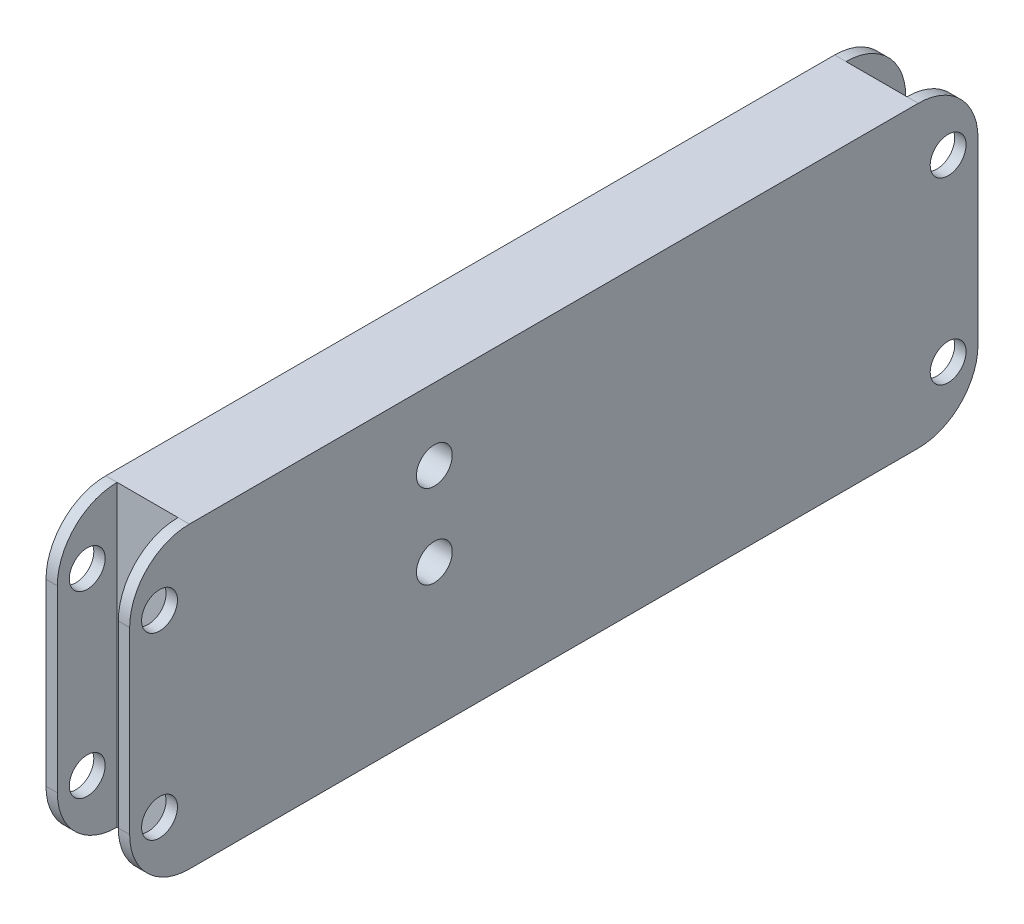
ISO-10303-21;
HEADER;
FILE_DESCRIPTION(('STEP AP214'),'2;1');
FILE_NAME('part.step','',(''),(''),'','','');
FILE_SCHEMA(('AUTOMOTIVE_DESIGN { 1 0 10303 214 1 1 1 1 }'));
ENDSEC;
DATA;
#1=APPLICATION_CONTEXT('core data for automotive mechanical design processes');
#2=APPLICATION_PROTOCOL_DEFINITION('international standard','automotive_design',2000,#1);
#3=PRODUCT_CONTEXT('',#1,'mechanical');
#4=PRODUCT('Part','Part','',(#3));
#5=PRODUCT_RELATED_PRODUCT_CATEGORY('part','',(#4));
#6=PRODUCT_DEFINITION_FORMATION('','',#4);
#7=PRODUCT_DEFINITION_CONTEXT('part definition',#1,'design');
#8=PRODUCT_DEFINITION('design','',#6,#7);
#9=PRODUCT_DEFINITION_SHAPE('','',#8);
#10=(LENGTH_UNIT() NAMED_UNIT(*) SI_UNIT(.MILLI.,.METRE.));
#11=(NAMED_UNIT(*) PLANE_ANGLE_UNIT() SI_UNIT($,.RADIAN.));
#12=(NAMED_UNIT(*) SI_UNIT($,.STERADIAN.) SOLID_ANGLE_UNIT());
#13=UNCERTAINTY_MEASURE_WITH_UNIT(LENGTH_MEASURE(1.E-05),#10,'distance_accuracy_value','');
#14=(GEOMETRIC_REPRESENTATION_CONTEXT(3) GLOBAL_UNCERTAINTY_ASSIGNED_CONTEXT((#13)) GLOBAL_UNIT_ASSIGNED_CONTEXT((#10,
#11,#12)) REPRESENTATION_CONTEXT('',''));
#15=CARTESIAN_POINT('',(0.,0.,0.));
#16=DIRECTION('',(0.,0.,1.));
#17=DIRECTION('',(1.,0.,0.));
#18=AXIS2_PLACEMENT_3D('',#15,#16,#17);
#19=CARTESIAN_POINT('',(-83.4298114071874,-147.075228064279,9.99999999999999));
#20=DIRECTION('',(1.,0.,0.));
#21=DIRECTION('',(0.,1.,0.));
#22=AXIS2_PLACEMENT_3D('',#19,#20,#21);
#23=CYLINDRICAL_SURFACE('',#22,1.5);
#24=CARTESIAN_POINT('',(-79.4298114071874,-147.075228064279,9.99999999999999));
#25=DIRECTION('',(-1.,0.,0.));
#26=DIRECTION('',(0.,-1.,0.));
#27=AXIS2_PLACEMENT_3D('',#24,#25,#26);
#28=CIRCLE('',#27,1.5);
#29=CARTESIAN_POINT('',(-79.4298114071874,-148.575228064279,9.99999999999999));
#30=VERTEX_POINT('',#29);
#31=EDGE_CURVE('E197',#30,#30,#28,.T.);
#32=ORIENTED_EDGE('',*,*,#31,.T.);
#33=EDGE_LOOP('',(#32));
#34=FACE_BOUND('',#33,.T.);
#35=CARTESIAN_POINT('',(-72.4298114071874,-147.075228064279,9.99999999999999));
#36=DIRECTION('',(-1.,0.,0.));
#37=DIRECTION('',(0.,-1.,0.));
#38=AXIS2_PLACEMENT_3D('',#35,#36,#37);
#39=CIRCLE('',#38,1.5);
#40=CARTESIAN_POINT('',(-72.4298114071874,-148.575228064279,9.99999999999999));
#41=VERTEX_POINT('',#40);
#42=EDGE_CURVE('E314',#41,#41,#39,.T.);
#43=ORIENTED_EDGE('',*,*,#42,.F.);
#44=EDGE_LOOP('',(#43));
#45=FACE_BOUND('',#44,.T.);
#46=ADVANCED_FACE('F34',(#34,#45),#23,.F.);
#47=CARTESIAN_POINT('',(-83.4298114071874,-154.075228064279,9.99999999999999));
#48=DIRECTION('',(1.,0.,0.));
#49=DIRECTION('',(0.,1.,0.));
#50=AXIS2_PLACEMENT_3D('',#47,#48,#49);
#51=CYLINDRICAL_SURFACE('',#50,1.5);
#52=CARTESIAN_POINT('',(-79.4298114071874,-154.075228064279,9.99999999999999));
#53=DIRECTION('',(-1.,0.,0.));
#54=DIRECTION('',(0.,-1.,0.));
#55=AXIS2_PLACEMENT_3D('',#52,#53,#54);
#56=CIRCLE('',#55,1.5);
#57=CARTESIAN_POINT('',(-79.4298114071874,-155.575228064279,9.99999999999999));
#58=VERTEX_POINT('',#57);
#59=EDGE_CURVE('E194',#58,#58,#56,.T.);
#60=ORIENTED_EDGE('',*,*,#59,.T.);
#61=EDGE_LOOP('',(#60));
#62=FACE_BOUND('',#61,.T.);
#63=CARTESIAN_POINT('',(-72.4298114071874,-154.075228064279,9.99999999999999));
#64=DIRECTION('',(-1.,0.,0.));
#65=DIRECTION('',(0.,-1.,0.));
#66=AXIS2_PLACEMENT_3D('',#63,#64,#65);
#67=CIRCLE('',#66,1.5);
#68=CARTESIAN_POINT('',(-72.4298114071874,-155.575228064279,9.99999999999999));
#69=VERTEX_POINT('',#68);
#70=EDGE_CURVE('E311',#69,#69,#67,.T.);
#71=ORIENTED_EDGE('',*,*,#70,.F.);
#72=EDGE_LOOP('',(#71));
#73=FACE_BOUND('',#72,.T.);
#74=ADVANCED_FACE('F419',(#62,#73),#51,.F.);
#75=CARTESIAN_POINT('',(-28.4298114071874,-161.075228064279,33.));
#76=DIRECTION('',(-1.,0.,0.));
#77=DIRECTION('',(0.,-1.,0.));
#78=AXIS2_PLACEMENT_3D('',#75,#76,#77);
#79=CYLINDRICAL_SURFACE('',#78,1.5);
#80=CARTESIAN_POINT('',(-78.4798114071874,-161.075228064279,33.));
#81=DIRECTION('',(-1.,0.,0.));
#82=DIRECTION('',(0.,0.,1.));
#83=AXIS2_PLACEMENT_3D('',#80,#81,#82);
#84=CIRCLE('',#83,1.5);
#85=CARTESIAN_POINT('',(-78.4798114071874,-161.075228064279,34.5));
#86=VERTEX_POINT('',#85);
#87=EDGE_CURVE('E292',#86,#86,#84,.F.);
#88=ORIENTED_EDGE('',*,*,#87,.T.);
#89=EDGE_LOOP('',(#88));
#90=FACE_BOUND('',#89,.T.);
#91=CARTESIAN_POINT('',(-79.4298114071874,-161.075228064279,33.));
#92=DIRECTION('',(-1.,0.,0.));
#93=DIRECTION('',(0.,-1.,0.));
#94=AXIS2_PLACEMENT_3D('',#91,#92,#93);
#95=CIRCLE('',#94,1.5);
#96=CARTESIAN_POINT('',(-79.4298114071874,-162.575228064279,33.));
#97=VERTEX_POINT('',#96);
#98=EDGE_CURVE('E200',#97,#97,#95,.T.);
#99=ORIENTED_EDGE('',*,*,#98,.T.);
#100=EDGE_LOOP('',(#99));
#101=FACE_BOUND('',#100,.T.);
#102=ADVANCED_FACE('F425',(#90,#101),#79,.F.);
#103=CARTESIAN_POINT('',(-28.4298114071874,-146.075228064279,33.));
#104=DIRECTION('',(-1.,0.,0.));
#105=DIRECTION('',(0.,-1.,0.));
#106=AXIS2_PLACEMENT_3D('',#103,#104,#105);
#107=CYLINDRICAL_SURFACE('',#106,1.5);
#108=CARTESIAN_POINT('',(-78.4798114071874,-146.075228064279,33.));
#109=DIRECTION('',(-1.,0.,0.));
#110=DIRECTION('',(0.,0.,1.));
#111=AXIS2_PLACEMENT_3D('',#108,#109,#110);
#112=CIRCLE('',#111,1.5);
#113=CARTESIAN_POINT('',(-78.4798114071874,-146.075228064279,34.5));
#114=VERTEX_POINT('',#113);
#115=EDGE_CURVE('E301',#114,#114,#112,.T.);
#116=ORIENTED_EDGE('',*,*,#115,.F.);
#117=EDGE_LOOP('',(#116));
#118=FACE_BOUND('',#117,.T.);
#119=CARTESIAN_POINT('',(-79.4298114071874,-146.075228064279,33.));
#120=DIRECTION('',(-1.,0.,0.));
#121=DIRECTION('',(0.,-1.,0.));
#122=AXIS2_PLACEMENT_3D('',#119,#120,#121);
#123=CIRCLE('',#122,1.5);
#124=CARTESIAN_POINT('',(-79.4298114071874,-147.575228064279,33.));
#125=VERTEX_POINT('',#124);
#126=EDGE_CURVE('E203',#125,#125,#123,.T.);
#127=ORIENTED_EDGE('',*,*,#126,.T.);
#128=EDGE_LOOP('',(#127));
#129=FACE_BOUND('',#128,.T.);
#130=ADVANCED_FACE('F456',(#118,#129),#107,.F.);
#131=CARTESIAN_POINT('',(-28.4298114071874,-161.075228064279,-33.));
#132=DIRECTION('',(-1.,0.,0.));
#133=DIRECTION('',(0.,-1.,0.));
#134=AXIS2_PLACEMENT_3D('',#131,#132,#133);
#135=CYLINDRICAL_SURFACE('',#134,1.5);
#136=CARTESIAN_POINT('',(-78.4798114071874,-161.075228064279,-33.));
#137=DIRECTION('',(-1.,0.,0.));
#138=DIRECTION('',(0.,0.,1.));
#139=AXIS2_PLACEMENT_3D('',#136,#137,#138);
#140=CIRCLE('',#139,1.5);
#141=CARTESIAN_POINT('',(-78.4798114071874,-161.075228064279,-31.5));
#142=VERTEX_POINT('',#141);
#143=EDGE_CURVE('E305',#142,#142,#140,.T.);
#144=ORIENTED_EDGE('',*,*,#143,.F.);
#145=EDGE_LOOP('',(#144));
#146=FACE_BOUND('',#145,.T.);
#147=CARTESIAN_POINT('',(-79.4298114071874,-161.075228064279,-33.));
#148=DIRECTION('',(-1.,0.,0.));
#149=DIRECTION('',(0.,-1.,0.));
#150=AXIS2_PLACEMENT_3D('',#147,#148,#149);
#151=CIRCLE('',#150,1.5);
#152=CARTESIAN_POINT('',(-79.4298114071874,-162.575228064279,-33.));
#153=VERTEX_POINT('',#152);
#154=EDGE_CURVE('E206',#153,#153,#151,.T.);
#155=ORIENTED_EDGE('',*,*,#154,.T.);
#156=EDGE_LOOP('',(#155));
#157=FACE_BOUND('',#156,.T.);
#158=ADVANCED_FACE('F397',(#146,#157),#135,.F.);
#159=CARTESIAN_POINT('',(-28.4298114071874,-146.075228064279,-33.));
#160=DIRECTION('',(-1.,0.,0.));
#161=DIRECTION('',(0.,-1.,0.));
#162=AXIS2_PLACEMENT_3D('',#159,#160,#161);
#163=CYLINDRICAL_SURFACE('',#162,1.5);
#164=CARTESIAN_POINT('',(-78.4798114071874,-146.075228064279,-33.));
#165=DIRECTION('',(-1.,0.,0.));
#166=DIRECTION('',(0.,0.,1.));
#167=AXIS2_PLACEMENT_3D('',#164,#165,#166);
#168=CIRCLE('',#167,1.5);
#169=CARTESIAN_POINT('',(-78.4798114071874,-146.075228064279,-31.5));
#170=VERTEX_POINT('',#169);
#171=EDGE_CURVE('E308',#170,#170,#168,.F.);
#172=ORIENTED_EDGE('',*,*,#171,.T.);
#173=EDGE_LOOP('',(#172));
#174=FACE_BOUND('',#173,.T.);
#175=CARTESIAN_POINT('',(-79.4298114071874,-146.075228064279,-33.));
#176=DIRECTION('',(-1.,0.,0.));
#177=DIRECTION('',(0.,-1.,0.));
#178=AXIS2_PLACEMENT_3D('',#175,#176,#177);
#179=CIRCLE('',#178,1.5);
#180=CARTESIAN_POINT('',(-79.4298114071874,-147.575228064279,-33.));
#181=VERTEX_POINT('',#180);
#182=EDGE_CURVE('E209',#181,#181,#179,.T.);
#183=ORIENTED_EDGE('',*,*,#182,.T.);
#184=EDGE_LOOP('',(#183));
#185=FACE_BOUND('',#184,.T.);
#186=ADVANCED_FACE('F410',(#174,#185),#163,.F.);
#187=CARTESIAN_POINT('',(-79.4298114071874,-146.075228064279,30.5));
#188=DIRECTION('',(1.,0.,0.));
#189=DIRECTION('',(0.,1.,0.));
#190=AXIS2_PLACEMENT_3D('',#187,#188,#189);
#191=PLANE('',#190);
#192=CARTESIAN_POINT('',(-79.4298114071874,-146.075228064279,30.5));
#193=DIRECTION('',(-1.,0.,0.));
#194=DIRECTION('',(0.,1.,0.));
#195=AXIS2_PLACEMENT_3D('',#192,#193,#194);
#196=CIRCLE('',#195,5.);
#197=CARTESIAN_POINT('',(-79.4298114071874,-146.075228064279,35.5));
#198=VERTEX_POINT('',#197);
#199=CARTESIAN_POINT('',(-79.4298114071874,-141.075228064279,30.5));
#200=VERTEX_POINT('',#199);
#201=EDGE_CURVE('E212',#198,#200,#196,.T.);
#202=ORIENTED_EDGE('',*,*,#201,.T.);
#203=DIRECTION('',(0.,0.,-1.));
#204=VECTOR('',#203,1.);
#205=CARTESIAN_POINT('',(-79.4298114071874,-141.075228064279,-30.5));
#206=LINE('',#205,#204);
#207=CARTESIAN_POINT('',(-79.4298114071874,-141.075228064279,-30.5));
#208=VERTEX_POINT('',#207);
#209=EDGE_CURVE('E214',#200,#208,#206,.T.);
#210=ORIENTED_EDGE('',*,*,#209,.T.);
#211=CARTESIAN_POINT('',(-79.4298114071874,-146.075228064279,-30.5));
#212=DIRECTION('',(-1.,0.,0.));
#213=DIRECTION('',(0.,-1.,0.));
#214=AXIS2_PLACEMENT_3D('',#211,#212,#213);
#215=CIRCLE('',#214,5.);
#216=CARTESIAN_POINT('',(-79.4298114071874,-146.075228064279,-35.5));
#217=VERTEX_POINT('',#216);
#218=EDGE_CURVE('E216',#208,#217,#215,.T.);
#219=ORIENTED_EDGE('',*,*,#218,.T.);
#220=DIRECTION('',(0.,-1.,0.));
#221=VECTOR('',#220,1.);
#222=CARTESIAN_POINT('',(-79.4298114071874,-146.075228064279,-35.5));
#223=LINE('',#222,#221);
#224=CARTESIAN_POINT('',(-79.4298114071874,-161.075228064279,-35.5));
#225=VERTEX_POINT('',#224);
#226=EDGE_CURVE('E218',#217,#225,#223,.T.);
#227=ORIENTED_EDGE('',*,*,#226,.T.);
#228=CARTESIAN_POINT('',(-79.4298114071874,-161.075228064279,-30.5));
#229=DIRECTION('',(-1.,0.,0.));
#230=DIRECTION('',(0.,-1.,0.));
#231=AXIS2_PLACEMENT_3D('',#228,#229,#230);
#232=CIRCLE('',#231,5.);
#233=CARTESIAN_POINT('',(-79.4298114071874,-166.075228064279,-30.5));
#234=VERTEX_POINT('',#233);
#235=EDGE_CURVE('E220',#225,#234,#232,.T.);
#236=ORIENTED_EDGE('',*,*,#235,.T.);
#237=DIRECTION('',(0.,0.,1.));
#238=VECTOR('',#237,1.);
#239=CARTESIAN_POINT('',(-79.4298114071874,-166.075228064279,-30.5));
#240=LINE('',#239,#238);
#241=CARTESIAN_POINT('',(-79.4298114071874,-166.075228064279,30.5));
#242=VERTEX_POINT('',#241);
#243=EDGE_CURVE('E222',#234,#242,#240,.T.);
#244=ORIENTED_EDGE('',*,*,#243,.T.);
#245=CARTESIAN_POINT('',(-79.4298114071874,-161.075228064279,30.5));
#246=DIRECTION('',(-1.,0.,0.));
#247=DIRECTION('',(0.,-1.,0.));
#248=AXIS2_PLACEMENT_3D('',#245,#246,#247);
#249=CIRCLE('',#248,5.);
#250=CARTESIAN_POINT('',(-79.4298114071874,-161.075228064279,35.5));
#251=VERTEX_POINT('',#250);
#252=EDGE_CURVE('E224',#242,#251,#249,.T.);
#253=ORIENTED_EDGE('',*,*,#252,.T.);
#254=DIRECTION('',(0.,1.,0.));
#255=VECTOR('',#254,1.);
#256=CARTESIAN_POINT('',(-79.4298114071874,-146.075228064279,35.5));
#257=LINE('',#256,#255);
#258=EDGE_CURVE('E57',#251,#198,#257,.T.);
#259=ORIENTED_EDGE('',*,*,#258,.T.);
#260=EDGE_LOOP('',(#202,#210,#219,#227,#236,#244,#253,#259));
#261=FACE_BOUND('',#260,.T.);
#262=ORIENTED_EDGE('',*,*,#182,.F.);
#263=EDGE_LOOP('',(#262));
#264=FACE_BOUND('',#263,.T.);
#265=ORIENTED_EDGE('',*,*,#154,.F.);
#266=EDGE_LOOP('',(#265));
#267=FACE_BOUND('',#266,.T.);
#268=ORIENTED_EDGE('',*,*,#126,.F.);
#269=EDGE_LOOP('',(#268));
#270=FACE_BOUND('',#269,.T.);
#271=ORIENTED_EDGE('',*,*,#98,.F.);
#272=EDGE_LOOP('',(#271));
#273=FACE_BOUND('',#272,.T.);
#274=ORIENTED_EDGE('',*,*,#31,.F.);
#275=EDGE_LOOP('',(#274));
#276=FACE_BOUND('',#275,.T.);
#277=ORIENTED_EDGE('',*,*,#59,.F.);
#278=EDGE_LOOP('',(#277));
#279=FACE_BOUND('',#278,.T.);
#280=ADVANCED_FACE('F261',(#261,#264,#267,#270,#273,#276,#279),#191,.F.);
#281=CARTESIAN_POINT('',(-73.3798114071874,-146.075228064279,-33.));
#282=DIRECTION('',(1.,0.,0.));
#283=DIRECTION('',(0.,0.,-1.));
#284=AXIS2_PLACEMENT_3D('',#281,#282,#283);
#285=CIRCLE('',#284,1.5);
#286=CARTESIAN_POINT('',(-73.3798114071874,-146.075228064279,-34.5));
#287=VERTEX_POINT('',#286);
#288=EDGE_CURVE('E290',#287,#287,#285,.F.);
#289=ORIENTED_EDGE('',*,*,#288,.T.);
#290=EDGE_LOOP('',(#289));
#291=FACE_BOUND('',#290,.T.);
#292=CARTESIAN_POINT('',(-72.4298114071874,-146.075228064279,-33.));
#293=DIRECTION('',(-1.,0.,0.));
#294=DIRECTION('',(0.,-1.,0.));
#295=AXIS2_PLACEMENT_3D('',#292,#293,#294);
#296=CIRCLE('',#295,1.5);
#297=CARTESIAN_POINT('',(-72.4298114071874,-147.575228064279,-33.));
#298=VERTEX_POINT('',#297);
#299=EDGE_CURVE('E326',#298,#298,#296,.T.);
#300=ORIENTED_EDGE('',*,*,#299,.F.);
#301=EDGE_LOOP('',(#300));
#302=FACE_BOUND('',#301,.T.);
#303=ADVANCED_FACE('F395',(#291,#302),#163,.F.);
#304=CARTESIAN_POINT('',(-73.3798114071874,-161.075228064279,-33.));
#305=DIRECTION('',(1.,0.,0.));
#306=DIRECTION('',(0.,0.,-1.));
#307=AXIS2_PLACEMENT_3D('',#304,#305,#306);
#308=CIRCLE('',#307,1.5);
#309=CARTESIAN_POINT('',(-73.3798114071874,-161.075228064279,-34.5));
#310=VERTEX_POINT('',#309);
#311=EDGE_CURVE('E295',#310,#310,#308,.T.);
#312=ORIENTED_EDGE('',*,*,#311,.F.);
#313=EDGE_LOOP('',(#312));
#314=FACE_BOUND('',#313,.T.);
#315=CARTESIAN_POINT('',(-72.4298114071874,-161.075228064279,-33.));
#316=DIRECTION('',(-1.,0.,0.));
#317=DIRECTION('',(0.,-1.,0.));
#318=AXIS2_PLACEMENT_3D('',#315,#316,#317);
#319=CIRCLE('',#318,1.5);
#320=CARTESIAN_POINT('',(-72.4298114071874,-162.575228064279,-33.));
#321=VERTEX_POINT('',#320);
#322=EDGE_CURVE('E323',#321,#321,#319,.T.);
#323=ORIENTED_EDGE('',*,*,#322,.F.);
#324=EDGE_LOOP('',(#323));
#325=FACE_BOUND('',#324,.T.);
#326=ADVANCED_FACE('F391',(#314,#325),#135,.F.);
#327=CARTESIAN_POINT('',(-73.3798114071874,-146.075228064279,33.));
#328=DIRECTION('',(1.,0.,0.));
#329=DIRECTION('',(0.,0.,-1.));
#330=AXIS2_PLACEMENT_3D('',#327,#328,#329);
#331=CIRCLE('',#330,1.5);
#332=CARTESIAN_POINT('',(-73.3798114071874,-146.075228064279,31.5));
#333=VERTEX_POINT('',#332);
#334=EDGE_CURVE('E156',#333,#333,#331,.T.);
#335=ORIENTED_EDGE('',*,*,#334,.F.);
#336=EDGE_LOOP('',(#335));
#337=FACE_BOUND('',#336,.T.);
#338=CARTESIAN_POINT('',(-72.4298114071874,-146.075228064279,33.));
#339=DIRECTION('',(-1.,0.,0.));
#340=DIRECTION('',(0.,-1.,0.));
#341=AXIS2_PLACEMENT_3D('',#338,#339,#340);
#342=CIRCLE('',#341,1.5);
#343=CARTESIAN_POINT('',(-72.4298114071874,-147.575228064279,33.));
#344=VERTEX_POINT('',#343);
#345=EDGE_CURVE('E320',#344,#344,#342,.T.);
#346=ORIENTED_EDGE('',*,*,#345,.F.);
#347=EDGE_LOOP('',(#346));
#348=FACE_BOUND('',#347,.T.);
#349=ADVANCED_FACE('F394',(#337,#348),#107,.F.);
#350=CARTESIAN_POINT('',(-73.3798114071874,-161.075228064279,33.));
#351=DIRECTION('',(1.,0.,0.));
#352=DIRECTION('',(0.,0.,-1.));
#353=AXIS2_PLACEMENT_3D('',#350,#351,#352);
#354=CIRCLE('',#353,1.5);
#355=CARTESIAN_POINT('',(-73.3798114071874,-161.075228064279,31.5));
#356=VERTEX_POINT('',#355);
#357=EDGE_CURVE('E375',#356,#356,#354,.F.);
#358=ORIENTED_EDGE('',*,*,#357,.T.);
#359=EDGE_LOOP('',(#358));
#360=FACE_BOUND('',#359,.T.);
#361=CARTESIAN_POINT('',(-72.4298114071874,-161.075228064279,33.));
#362=DIRECTION('',(-1.,0.,0.));
#363=DIRECTION('',(0.,-1.,0.));
#364=AXIS2_PLACEMENT_3D('',#361,#362,#363);
#365=CIRCLE('',#364,1.5);
#366=CARTESIAN_POINT('',(-72.4298114071874,-162.575228064279,33.));
#367=VERTEX_POINT('',#366);
#368=EDGE_CURVE('E317',#367,#367,#365,.T.);
#369=ORIENTED_EDGE('',*,*,#368,.F.);
#370=EDGE_LOOP('',(#369));
#371=FACE_BOUND('',#370,.T.);
#372=ADVANCED_FACE('F402',(#360,#371),#79,.F.);
#373=CARTESIAN_POINT('',(-72.4298114071874,-146.075228064279,30.5));
#374=DIRECTION('',(-1.,0.,0.));
#375=DIRECTION('',(0.,1.,0.));
#376=AXIS2_PLACEMENT_3D('',#373,#374,#375);
#377=PLANE('',#376);
#378=ORIENTED_EDGE('',*,*,#70,.T.);
#379=EDGE_LOOP('',(#378));
#380=FACE_BOUND('',#379,.T.);
#381=ORIENTED_EDGE('',*,*,#42,.T.);
#382=EDGE_LOOP('',(#381));
#383=FACE_BOUND('',#382,.T.);
#384=ORIENTED_EDGE('',*,*,#368,.T.);
#385=EDGE_LOOP('',(#384));
#386=FACE_BOUND('',#385,.T.);
#387=ORIENTED_EDGE('',*,*,#345,.T.);
#388=EDGE_LOOP('',(#387));
#389=FACE_BOUND('',#388,.T.);
#390=ORIENTED_EDGE('',*,*,#322,.T.);
#391=EDGE_LOOP('',(#390));
#392=FACE_BOUND('',#391,.T.);
#393=ORIENTED_EDGE('',*,*,#299,.T.);
#394=EDGE_LOOP('',(#393));
#395=FACE_BOUND('',#394,.T.);
#396=CARTESIAN_POINT('',(-72.4298114071874,-146.075228064279,30.5));
#397=DIRECTION('',(-1.,0.,0.));
#398=DIRECTION('',(0.,1.,0.));
#399=AXIS2_PLACEMENT_3D('',#396,#397,#398);
#400=CIRCLE('',#399,5.);
#401=CARTESIAN_POINT('',(-72.4298114071874,-146.075228064279,35.5));
#402=VERTEX_POINT('',#401);
#403=CARTESIAN_POINT('',(-72.4298114071874,-141.075228064279,30.5));
#404=VERTEX_POINT('',#403);
#405=EDGE_CURVE('E329',#402,#404,#400,.T.);
#406=ORIENTED_EDGE('',*,*,#405,.F.);
#407=DIRECTION('',(0.,1.,0.));
#408=VECTOR('',#407,1.);
#409=CARTESIAN_POINT('',(-72.4298114071874,-146.075228064279,35.5));
#410=LINE('',#409,#408);
#411=CARTESIAN_POINT('',(-72.4298114071874,-161.075228064279,35.5));
#412=VERTEX_POINT('',#411);
#413=EDGE_CURVE('E332',#412,#402,#410,.T.);
#414=ORIENTED_EDGE('',*,*,#413,.F.);
#415=CARTESIAN_POINT('',(-72.4298114071874,-161.075228064279,30.5));
#416=DIRECTION('',(-1.,0.,0.));
#417=DIRECTION('',(0.,-1.,0.));
#418=AXIS2_PLACEMENT_3D('',#415,#416,#417);
#419=CIRCLE('',#418,5.);
#420=CARTESIAN_POINT('',(-72.4298114071874,-166.075228064279,30.5));
#421=VERTEX_POINT('',#420);
#422=EDGE_CURVE('E335',#421,#412,#419,.T.);
#423=ORIENTED_EDGE('',*,*,#422,.F.);
#424=DIRECTION('',(0.,0.,1.));
#425=VECTOR('',#424,1.);
#426=CARTESIAN_POINT('',(-72.4298114071874,-166.075228064279,-30.5));
#427=LINE('',#426,#425);
#428=CARTESIAN_POINT('',(-72.4298114071874,-166.075228064279,-30.5));
#429=VERTEX_POINT('',#428);
#430=EDGE_CURVE('E338',#429,#421,#427,.T.);
#431=ORIENTED_EDGE('',*,*,#430,.F.);
#432=CARTESIAN_POINT('',(-72.4298114071874,-161.075228064279,-30.5));
#433=DIRECTION('',(-1.,0.,0.));
#434=DIRECTION('',(0.,-1.,0.));
#435=AXIS2_PLACEMENT_3D('',#432,#433,#434);
#436=CIRCLE('',#435,5.);
#437=CARTESIAN_POINT('',(-72.4298114071874,-161.075228064279,-35.5));
#438=VERTEX_POINT('',#437);
#439=EDGE_CURVE('E181',#438,#429,#436,.T.);
#440=ORIENTED_EDGE('',*,*,#439,.F.);
#441=DIRECTION('',(0.,-1.,0.));
#442=VECTOR('',#441,1.);
#443=CARTESIAN_POINT('',(-72.4298114071874,-146.075228064279,-35.5));
#444=LINE('',#443,#442);
#445=CARTESIAN_POINT('',(-72.4298114071874,-146.075228064279,-35.5));
#446=VERTEX_POINT('',#445);
#447=EDGE_CURVE('E341',#446,#438,#444,.T.);
#448=ORIENTED_EDGE('',*,*,#447,.F.);
#449=CARTESIAN_POINT('',(-72.4298114071874,-146.075228064279,-30.5));
#450=DIRECTION('',(-1.,0.,0.));
#451=DIRECTION('',(0.,-1.,0.));
#452=AXIS2_PLACEMENT_3D('',#449,#450,#451);
#453=CIRCLE('',#452,5.);
#454=CARTESIAN_POINT('',(-72.4298114071874,-141.075228064279,-30.5));
#455=VERTEX_POINT('',#454);
#456=EDGE_CURVE('E344',#455,#446,#453,.T.);
#457=ORIENTED_EDGE('',*,*,#456,.F.);
#458=DIRECTION('',(0.,0.,-1.));
#459=VECTOR('',#458,1.);
#460=CARTESIAN_POINT('',(-72.4298114071874,-141.075228064279,-30.5));
#461=LINE('',#460,#459);
#462=EDGE_CURVE('E347',#404,#455,#461,.T.);
#463=ORIENTED_EDGE('',*,*,#462,.F.);
#464=EDGE_LOOP('',(#406,#414,#423,#431,#440,#448,#457,#463));
#465=FACE_BOUND('',#464,.T.);
#466=ADVANCED_FACE('F362',(#380,#383,#386,#389,#392,#395,#465),#377,.F.);
#467=CARTESIAN_POINT('',(-79.4298114071874,-146.075228064279,35.5));
#468=DIRECTION('',(0.,0.,-1.));
#469=DIRECTION('',(0.,1.,0.));
#470=AXIS2_PLACEMENT_3D('',#467,#468,#469);
#471=PLANE('',#470);
#472=DIRECTION('',(1.,0.,0.));
#473=VECTOR('',#472,1.);
#474=CARTESIAN_POINT('',(-79.4298114071874,-161.075228064279,35.5));
#475=LINE('',#474,#473);
#476=CARTESIAN_POINT('',(-78.4798114071874,-161.075228064279,35.5));
#477=VERTEX_POINT('',#476);
#478=EDGE_CURVE('E230',#251,#477,#475,.T.);
#479=ORIENTED_EDGE('',*,*,#478,.T.);
#480=DIRECTION('',(0.,1.,0.));
#481=VECTOR('',#480,1.);
#482=CARTESIAN_POINT('',(-78.4798114071874,-146.075228064279,35.5));
#483=LINE('',#482,#481);
#484=CARTESIAN_POINT('',(-78.4798114071874,-146.075228064279,35.5));
#485=VERTEX_POINT('',#484);
#486=EDGE_CURVE('E42',#477,#485,#483,.T.);
#487=ORIENTED_EDGE('',*,*,#486,.T.);
#488=DIRECTION('',(1.,0.,0.));
#489=VECTOR('',#488,1.);
#490=CARTESIAN_POINT('',(-79.4298114071874,-146.075228064279,35.5));
#491=LINE('',#490,#489);
#492=EDGE_CURVE('E227',#198,#485,#491,.T.);
#493=ORIENTED_EDGE('',*,*,#492,.F.);
#494=ORIENTED_EDGE('',*,*,#258,.F.);
#495=EDGE_LOOP('',(#479,#487,#493,#494));
#496=FACE_BOUND('',#495,.T.);
#497=ADVANCED_FACE('F250',(#496),#471,.F.);
#498=CARTESIAN_POINT('',(-3.40999180031226,-141.075228064279,-30.5));
#499=DIRECTION('',(0.,-1.,0.));
#500=DIRECTION('',(1.,0.,0.));
#501=AXIS2_PLACEMENT_3D('',#498,#499,#500);
#502=PLANE('',#501);
#503=DIRECTION('',(-1.,0.,0.));
#504=VECTOR('',#503,1.);
#505=CARTESIAN_POINT('',(0.,-141.075228064279,-30.5));
#506=LINE('',#505,#504);
#507=CARTESIAN_POINT('',(-73.3798114071874,-141.075228064279,-30.5));
#508=VERTEX_POINT('',#507);
#509=CARTESIAN_POINT('',(-78.4798114071874,-141.075228064279,-30.5));
#510=VERTEX_POINT('',#509);
#511=EDGE_CURVE('E164',#508,#510,#506,.T.);
#512=ORIENTED_EDGE('',*,*,#511,.T.);
#513=DIRECTION('',(1.,0.,0.));
#514=VECTOR('',#513,1.);
#515=CARTESIAN_POINT('',(-79.4298114071874,-141.075228064279,-30.5));
#516=LINE('',#515,#514);
#517=EDGE_CURVE('E243',#208,#510,#516,.T.);
#518=ORIENTED_EDGE('',*,*,#517,.F.);
#519=ORIENTED_EDGE('',*,*,#209,.F.);
#520=DIRECTION('',(1.,0.,0.));
#521=VECTOR('',#520,1.);
#522=CARTESIAN_POINT('',(-79.4298114071874,-141.075228064279,30.5));
#523=LINE('',#522,#521);
#524=CARTESIAN_POINT('',(-78.4798114071874,-141.075228064279,30.5));
#525=VERTEX_POINT('',#524);
#526=EDGE_CURVE('E246',#200,#525,#523,.T.);
#527=ORIENTED_EDGE('',*,*,#526,.T.);
#528=DIRECTION('',(1.,0.,0.));
#529=VECTOR('',#528,1.);
#530=CARTESIAN_POINT('',(0.,-141.075228064279,30.5));
#531=LINE('',#530,#529);
#532=CARTESIAN_POINT('',(-73.3798114071874,-141.075228064279,30.5));
#533=VERTEX_POINT('',#532);
#534=EDGE_CURVE('E525',#525,#533,#531,.T.);
#535=ORIENTED_EDGE('',*,*,#534,.T.);
#536=DIRECTION('',(-1.,0.,0.));
#537=VECTOR('',#536,1.);
#538=CARTESIAN_POINT('',(-72.4298114071874,-141.075228064279,30.5));
#539=LINE('',#538,#537);
#540=EDGE_CURVE('E350',#404,#533,#539,.T.);
#541=ORIENTED_EDGE('',*,*,#540,.F.);
#542=ORIENTED_EDGE('',*,*,#462,.T.);
#543=DIRECTION('',(-1.,0.,0.));
#544=VECTOR('',#543,1.);
#545=CARTESIAN_POINT('',(-72.4298114071874,-141.075228064279,-30.5));
#546=LINE('',#545,#544);
#547=EDGE_CURVE('E353',#455,#508,#546,.T.);
#548=ORIENTED_EDGE('',*,*,#547,.T.);
#549=EDGE_LOOP('',(#512,#518,#519,#527,#535,#541,#542,#548));
#550=FACE_BOUND('',#549,.T.);
#551=ADVANCED_FACE('F36',(#550),#502,.F.);
#552=CARTESIAN_POINT('',(0.,-166.075228064279,-88.5));
#553=DIRECTION('',(0.,-1.,0.));
#554=DIRECTION('',(0.,0.,-1.));
#555=AXIS2_PLACEMENT_3D('',#552,#553,#554);
#556=PLANE('',#555);
#557=DIRECTION('',(1.,0.,0.));
#558=VECTOR('',#557,1.);
#559=CARTESIAN_POINT('',(-79.4298114071874,-166.075228064279,-30.5));
#560=LINE('',#559,#558);
#561=CARTESIAN_POINT('',(-78.4798114071874,-166.075228064279,-30.5));
#562=VERTEX_POINT('',#561);
#563=EDGE_CURVE('E175',#234,#562,#560,.T.);
#564=ORIENTED_EDGE('',*,*,#563,.T.);
#565=DIRECTION('',(-1.,0.,0.));
#566=VECTOR('',#565,1.);
#567=CARTESIAN_POINT('',(-72.4298114071874,-166.075228064279,-30.5));
#568=LINE('',#567,#566);
#569=CARTESIAN_POINT('',(-73.3798114071874,-166.075228064279,-30.5));
#570=VERTEX_POINT('',#569);
#571=EDGE_CURVE('E162',#570,#562,#568,.T.);
#572=ORIENTED_EDGE('',*,*,#571,.F.);
#573=EDGE_CURVE('E171',#429,#570,#568,.T.);
#574=ORIENTED_EDGE('',*,*,#573,.F.);
#575=ORIENTED_EDGE('',*,*,#430,.T.);
#576=DIRECTION('',(-1.,0.,0.));
#577=VECTOR('',#576,1.);
#578=CARTESIAN_POINT('',(-72.4298114071874,-166.075228064279,30.5));
#579=LINE('',#578,#577);
#580=CARTESIAN_POINT('',(-73.3798114071874,-166.075228064279,30.5));
#581=VERTEX_POINT('',#580);
#582=EDGE_CURVE('E182',#421,#581,#579,.T.);
#583=ORIENTED_EDGE('',*,*,#582,.T.);
#584=DIRECTION('',(-1.,0.,0.));
#585=VECTOR('',#584,1.);
#586=CARTESIAN_POINT('',(0.,-166.075228064279,30.5));
#587=LINE('',#586,#585);
#588=CARTESIAN_POINT('',(-78.4798114071874,-166.075228064279,30.5));
#589=VERTEX_POINT('',#588);
#590=EDGE_CURVE('E284',#581,#589,#587,.T.);
#591=ORIENTED_EDGE('',*,*,#590,.T.);
#592=DIRECTION('',(1.,0.,0.));
#593=VECTOR('',#592,1.);
#594=CARTESIAN_POINT('',(-79.4298114071874,-166.075228064279,30.5));
#595=LINE('',#594,#593);
#596=EDGE_CURVE('E233',#242,#589,#595,.T.);
#597=ORIENTED_EDGE('',*,*,#596,.F.);
#598=ORIENTED_EDGE('',*,*,#243,.F.);
#599=EDGE_LOOP('',(#564,#572,#574,#575,#583,#591,#597,#598));
#600=FACE_BOUND('',#599,.T.);
#601=ADVANCED_FACE('F169',(#600),#556,.T.);
#602=CARTESIAN_POINT('',(-72.4298114071874,-146.075228064279,-35.5));
#603=DIRECTION('',(0.,0.,-1.));
#604=DIRECTION('',(-1.,0.,0.));
#605=AXIS2_PLACEMENT_3D('',#602,#603,#604);
#606=PLANE('',#605);
#607=DIRECTION('',(0.,-1.,0.));
#608=VECTOR('',#607,1.);
#609=CARTESIAN_POINT('',(-73.3798114071874,-133.933099530012,-35.5));
#610=LINE('',#609,#608);
#611=CARTESIAN_POINT('',(-73.3798114071874,-146.075228064279,-35.5));
#612=VERTEX_POINT('',#611);
#613=CARTESIAN_POINT('',(-73.3798114071874,-161.075228064279,-35.5));
#614=VERTEX_POINT('',#613);
#615=EDGE_CURVE('E152',#612,#614,#610,.T.);
#616=ORIENTED_EDGE('',*,*,#615,.F.);
#617=DIRECTION('',(-1.,0.,0.));
#618=VECTOR('',#617,1.);
#619=CARTESIAN_POINT('',(-72.4298114071874,-146.075228064279,-35.5));
#620=LINE('',#619,#618);
#621=EDGE_CURVE('E354',#446,#612,#620,.T.);
#622=ORIENTED_EDGE('',*,*,#621,.F.);
#623=ORIENTED_EDGE('',*,*,#447,.T.);
#624=DIRECTION('',(-1.,0.,0.));
#625=VECTOR('',#624,1.);
#626=CARTESIAN_POINT('',(-72.4298114071874,-161.075228064279,-35.5));
#627=LINE('',#626,#625);
#628=EDGE_CURVE('E176',#438,#614,#627,.T.);
#629=ORIENTED_EDGE('',*,*,#628,.T.);
#630=EDGE_LOOP('',(#616,#622,#623,#629));
#631=FACE_BOUND('',#630,.T.);
#632=ADVANCED_FACE('F358',(#631),#606,.T.);
#633=CARTESIAN_POINT('',(-72.4298114071874,-161.075228064279,-30.5));
#634=DIRECTION('',(-1.,0.,0.));
#635=DIRECTION('',(0.,-1.,0.));
#636=AXIS2_PLACEMENT_3D('',#633,#634,#635);
#637=CYLINDRICAL_SURFACE('',#636,5.);
#638=CARTESIAN_POINT('',(-73.3798114071874,-161.075228064279,-30.5));
#639=DIRECTION('',(1.,0.,0.));
#640=DIRECTION('',(0.,0.,-1.));
#641=AXIS2_PLACEMENT_3D('',#638,#639,#640);
#642=CIRCLE('',#641,5.);
#643=EDGE_CURVE('E147',#614,#570,#642,.F.);
#644=ORIENTED_EDGE('',*,*,#643,.F.);
#645=ORIENTED_EDGE('',*,*,#628,.F.);
#646=ORIENTED_EDGE('',*,*,#439,.T.);
#647=ORIENTED_EDGE('',*,*,#573,.T.);
#648=EDGE_LOOP('',(#644,#645,#646,#647));
#649=FACE_BOUND('',#648,.T.);
#650=ADVANCED_FACE('F179',(#649),#637,.T.);
#651=CARTESIAN_POINT('',(-72.4298114071874,-161.075228064279,30.5));
#652=DIRECTION('',(-1.,0.,0.));
#653=DIRECTION('',(0.,-1.,0.));
#654=AXIS2_PLACEMENT_3D('',#651,#652,#653);
#655=CYLINDRICAL_SURFACE('',#654,5.);
#656=CARTESIAN_POINT('',(-73.3798114071874,-161.075228064279,30.5));
#657=DIRECTION('',(1.,0.,0.));
#658=DIRECTION('',(0.,0.,-1.));
#659=AXIS2_PLACEMENT_3D('',#656,#657,#658);
#660=CIRCLE('',#659,5.);
#661=CARTESIAN_POINT('',(-73.3798114071874,-161.075228064279,35.5));
#662=VERTEX_POINT('',#661);
#663=EDGE_CURVE('E369',#581,#662,#660,.F.);
#664=ORIENTED_EDGE('',*,*,#663,.F.);
#665=ORIENTED_EDGE('',*,*,#582,.F.);
#666=ORIENTED_EDGE('',*,*,#422,.T.);
#667=DIRECTION('',(-1.,0.,0.));
#668=VECTOR('',#667,1.);
#669=CARTESIAN_POINT('',(-72.4298114071874,-161.075228064279,35.5));
#670=LINE('',#669,#668);
#671=EDGE_CURVE('E184',#412,#662,#670,.T.);
#672=ORIENTED_EDGE('',*,*,#671,.T.);
#673=EDGE_LOOP('',(#664,#665,#666,#672));
#674=FACE_BOUND('',#673,.T.);
#675=ADVANCED_FACE('F368',(#674),#655,.T.);
#676=CARTESIAN_POINT('',(-72.4298114071874,-146.075228064279,35.5));
#677=DIRECTION('',(0.,0.,1.));
#678=DIRECTION('',(0.,-1.,0.));
#679=AXIS2_PLACEMENT_3D('',#676,#677,#678);
#680=PLANE('',#679);
#681=DIRECTION('',(0.,-1.,0.));
#682=VECTOR('',#681,1.);
#683=CARTESIAN_POINT('',(-73.3798114071874,-133.933099530012,35.5));
#684=LINE('',#683,#682);
#685=CARTESIAN_POINT('',(-73.3798114071874,-146.075228064279,35.5));
#686=VERTEX_POINT('',#685);
#687=EDGE_CURVE('E380',#686,#662,#684,.T.);
#688=ORIENTED_EDGE('',*,*,#687,.T.);
#689=ORIENTED_EDGE('',*,*,#671,.F.);
#690=ORIENTED_EDGE('',*,*,#413,.T.);
#691=DIRECTION('',(-1.,0.,0.));
#692=VECTOR('',#691,1.);
#693=CARTESIAN_POINT('',(-72.4298114071874,-146.075228064279,35.5));
#694=LINE('',#693,#692);
#695=EDGE_CURVE('E191',#402,#686,#694,.T.);
#696=ORIENTED_EDGE('',*,*,#695,.T.);
#697=EDGE_LOOP('',(#688,#689,#690,#696));
#698=FACE_BOUND('',#697,.T.);
#699=ADVANCED_FACE('F515',(#698),#680,.T.);
#700=CARTESIAN_POINT('',(-72.4298114071874,-146.075228064279,30.5));
#701=DIRECTION('',(-1.,0.,0.));
#702=DIRECTION('',(0.,-1.,0.));
#703=AXIS2_PLACEMENT_3D('',#700,#701,#702);
#704=CYLINDRICAL_SURFACE('',#703,5.);
#705=CARTESIAN_POINT('',(-73.3798114071874,-146.075228064279,30.5));
#706=DIRECTION('',(1.,0.,0.));
#707=DIRECTION('',(0.,0.,-1.));
#708=AXIS2_PLACEMENT_3D('',#705,#706,#707);
#709=CIRCLE('',#708,5.);
#710=EDGE_CURVE('E372',#686,#533,#709,.F.);
#711=ORIENTED_EDGE('',*,*,#710,.F.);
#712=ORIENTED_EDGE('',*,*,#695,.F.);
#713=ORIENTED_EDGE('',*,*,#405,.T.);
#714=ORIENTED_EDGE('',*,*,#540,.T.);
#715=EDGE_LOOP('',(#711,#712,#713,#714));
#716=FACE_BOUND('',#715,.T.);
#717=ADVANCED_FACE('F509',(#716),#704,.T.);
#718=CARTESIAN_POINT('',(-72.4298114071874,-146.075228064279,-30.5));
#719=DIRECTION('',(-1.,0.,0.));
#720=DIRECTION('',(0.,-1.,0.));
#721=AXIS2_PLACEMENT_3D('',#718,#719,#720);
#722=CYLINDRICAL_SURFACE('',#721,5.);
#723=CARTESIAN_POINT('',(-73.3798114071874,-146.075228064279,-30.5));
#724=DIRECTION('',(1.,0.,0.));
#725=DIRECTION('',(0.,0.,-1.));
#726=AXIS2_PLACEMENT_3D('',#723,#724,#725);
#727=CIRCLE('',#726,5.);
#728=EDGE_CURVE('E49',#508,#612,#727,.F.);
#729=ORIENTED_EDGE('',*,*,#728,.F.);
#730=ORIENTED_EDGE('',*,*,#547,.F.);
#731=ORIENTED_EDGE('',*,*,#456,.T.);
#732=ORIENTED_EDGE('',*,*,#621,.T.);
#733=EDGE_LOOP('',(#729,#730,#731,#732));
#734=FACE_BOUND('',#733,.T.);
#735=ADVANCED_FACE('F444',(#734),#722,.T.);
#736=CARTESIAN_POINT('',(-79.4298114071874,-161.075228064279,30.5));
#737=DIRECTION('',(1.,0.,0.));
#738=DIRECTION('',(0.,1.,0.));
#739=AXIS2_PLACEMENT_3D('',#736,#737,#738);
#740=CYLINDRICAL_SURFACE('',#739,5.);
#741=ORIENTED_EDGE('',*,*,#596,.T.);
#742=CARTESIAN_POINT('',(-78.4798114071874,-161.075228064279,30.5));
#743=DIRECTION('',(-1.,0.,0.));
#744=DIRECTION('',(0.,0.,1.));
#745=AXIS2_PLACEMENT_3D('',#742,#743,#744);
#746=CIRCLE('',#745,5.);
#747=EDGE_CURVE('E287',#589,#477,#746,.T.);
#748=ORIENTED_EDGE('',*,*,#747,.T.);
#749=ORIENTED_EDGE('',*,*,#478,.F.);
#750=ORIENTED_EDGE('',*,*,#252,.F.);
#751=EDGE_LOOP('',(#741,#748,#749,#750));
#752=FACE_BOUND('',#751,.T.);
#753=ADVANCED_FACE('F286',(#752),#740,.T.);
#754=CARTESIAN_POINT('',(-79.4298114071874,-161.075228064279,-30.5));
#755=DIRECTION('',(1.,0.,0.));
#756=DIRECTION('',(0.,1.,0.));
#757=AXIS2_PLACEMENT_3D('',#754,#755,#756);
#758=CYLINDRICAL_SURFACE('',#757,5.);
#759=DIRECTION('',(1.,0.,0.));
#760=VECTOR('',#759,1.);
#761=CARTESIAN_POINT('',(-79.4298114071874,-161.075228064279,-35.5));
#762=LINE('',#761,#760);
#763=CARTESIAN_POINT('',(-78.4798114071874,-161.075228064279,-35.5));
#764=VERTEX_POINT('',#763);
#765=EDGE_CURVE('E237',#225,#764,#762,.T.);
#766=ORIENTED_EDGE('',*,*,#765,.T.);
#767=CARTESIAN_POINT('',(-78.4798114071874,-161.075228064279,-30.5));
#768=DIRECTION('',(-1.,0.,0.));
#769=DIRECTION('',(0.,0.,1.));
#770=AXIS2_PLACEMENT_3D('',#767,#768,#769);
#771=CIRCLE('',#770,5.);
#772=EDGE_CURVE('E11',#764,#562,#771,.T.);
#773=ORIENTED_EDGE('',*,*,#772,.T.);
#774=ORIENTED_EDGE('',*,*,#563,.F.);
#775=ORIENTED_EDGE('',*,*,#235,.F.);
#776=EDGE_LOOP('',(#766,#773,#774,#775));
#777=FACE_BOUND('',#776,.T.);
#778=ADVANCED_FACE('F281',(#777),#758,.T.);
#779=CARTESIAN_POINT('',(-79.4298114071874,-146.075228064279,-35.5));
#780=DIRECTION('',(0.,0.,1.));
#781=DIRECTION('',(1.,0.,0.));
#782=AXIS2_PLACEMENT_3D('',#779,#780,#781);
#783=PLANE('',#782);
#784=DIRECTION('',(1.,0.,0.));
#785=VECTOR('',#784,1.);
#786=CARTESIAN_POINT('',(-79.4298114071874,-146.075228064279,-35.5));
#787=LINE('',#786,#785);
#788=CARTESIAN_POINT('',(-78.4798114071874,-146.075228064279,-35.5));
#789=VERTEX_POINT('',#788);
#790=EDGE_CURVE('E240',#217,#789,#787,.T.);
#791=ORIENTED_EDGE('',*,*,#790,.T.);
#792=DIRECTION('',(0.,-1.,0.));
#793=VECTOR('',#792,1.);
#794=CARTESIAN_POINT('',(-78.4798114071874,-133.933099530012,-35.5));
#795=LINE('',#794,#793);
#796=EDGE_CURVE('E377',#789,#764,#795,.T.);
#797=ORIENTED_EDGE('',*,*,#796,.T.);
#798=ORIENTED_EDGE('',*,*,#765,.F.);
#799=ORIENTED_EDGE('',*,*,#226,.F.);
#800=EDGE_LOOP('',(#791,#797,#798,#799));
#801=FACE_BOUND('',#800,.T.);
#802=ADVANCED_FACE('F277',(#801),#783,.F.);
#803=CARTESIAN_POINT('',(-79.4298114071874,-146.075228064279,-30.5));
#804=DIRECTION('',(1.,0.,0.));
#805=DIRECTION('',(0.,1.,0.));
#806=AXIS2_PLACEMENT_3D('',#803,#804,#805);
#807=CYLINDRICAL_SURFACE('',#806,5.);
#808=ORIENTED_EDGE('',*,*,#517,.T.);
#809=CARTESIAN_POINT('',(-78.4798114071874,-146.075228064279,-30.5));
#810=DIRECTION('',(-1.,0.,0.));
#811=DIRECTION('',(0.,0.,1.));
#812=AXIS2_PLACEMENT_3D('',#809,#810,#811);
#813=CIRCLE('',#812,5.);
#814=EDGE_CURVE('E273',#510,#789,#813,.T.);
#815=ORIENTED_EDGE('',*,*,#814,.T.);
#816=ORIENTED_EDGE('',*,*,#790,.F.);
#817=ORIENTED_EDGE('',*,*,#218,.F.);
#818=EDGE_LOOP('',(#808,#815,#816,#817));
#819=FACE_BOUND('',#818,.T.);
#820=ADVANCED_FACE('F271',(#819),#807,.T.);
#821=CARTESIAN_POINT('',(-79.4298114071874,-146.075228064279,30.5));
#822=DIRECTION('',(1.,0.,0.));
#823=DIRECTION('',(0.,1.,0.));
#824=AXIS2_PLACEMENT_3D('',#821,#822,#823);
#825=CYLINDRICAL_SURFACE('',#824,5.);
#826=ORIENTED_EDGE('',*,*,#492,.T.);
#827=CARTESIAN_POINT('',(-78.4798114071874,-146.075228064279,30.5));
#828=DIRECTION('',(-1.,0.,0.));
#829=DIRECTION('',(0.,0.,1.));
#830=AXIS2_PLACEMENT_3D('',#827,#828,#829);
#831=CIRCLE('',#830,5.);
#832=EDGE_CURVE('E260',#485,#525,#831,.T.);
#833=ORIENTED_EDGE('',*,*,#832,.T.);
#834=ORIENTED_EDGE('',*,*,#526,.F.);
#835=ORIENTED_EDGE('',*,*,#201,.F.);
#836=EDGE_LOOP('',(#826,#833,#834,#835));
#837=FACE_BOUND('',#836,.T.);
#838=ADVANCED_FACE('F258',(#837),#825,.T.);
#839=CARTESIAN_POINT('',(-73.3798114071874,-133.933099530012,0.));
#840=DIRECTION('',(1.,0.,0.));
#841=DIRECTION('',(0.,0.,-1.));
#842=AXIS2_PLACEMENT_3D('',#839,#840,#841);
#843=PLANE('',#842);
#844=ORIENTED_EDGE('',*,*,#728,.T.);
#845=ORIENTED_EDGE('',*,*,#615,.T.);
#846=ORIENTED_EDGE('',*,*,#643,.T.);
#847=DIRECTION('',(0.,-1.,0.));
#848=VECTOR('',#847,1.);
#849=CARTESIAN_POINT('',(-73.3798114071874,-133.933099530012,-30.5));
#850=LINE('',#849,#848);
#851=EDGE_CURVE('E151',#508,#570,#850,.T.);
#852=ORIENTED_EDGE('',*,*,#851,.F.);
#853=EDGE_LOOP('',(#844,#845,#846,#852));
#854=FACE_BOUND('',#853,.T.);
#855=ORIENTED_EDGE('',*,*,#311,.T.);
#856=EDGE_LOOP('',(#855));
#857=FACE_BOUND('',#856,.T.);
#858=ORIENTED_EDGE('',*,*,#288,.F.);
#859=EDGE_LOOP('',(#858));
#860=FACE_BOUND('',#859,.T.);
#861=ADVANCED_FACE('F149',(#854,#857,#860),#843,.F.);
#862=CARTESIAN_POINT('',(0.,-133.933099530012,-30.5));
#863=DIRECTION('',(0.,0.,-1.));
#864=DIRECTION('',(-1.,0.,0.));
#865=AXIS2_PLACEMENT_3D('',#862,#863,#864);
#866=PLANE('',#865);
#867=ORIENTED_EDGE('',*,*,#851,.T.);
#868=ORIENTED_EDGE('',*,*,#571,.T.);
#869=DIRECTION('',(0.,-1.,0.));
#870=VECTOR('',#869,1.);
#871=CARTESIAN_POINT('',(-78.4798114071874,-133.933099530012,-30.5));
#872=LINE('',#871,#870);
#873=EDGE_CURVE('E165',#510,#562,#872,.T.);
#874=ORIENTED_EDGE('',*,*,#873,.F.);
#875=ORIENTED_EDGE('',*,*,#511,.F.);
#876=EDGE_LOOP('',(#867,#868,#874,#875));
#877=FACE_BOUND('',#876,.T.);
#878=ADVANCED_FACE('F160',(#877),#866,.T.);
#879=CARTESIAN_POINT('',(-78.4798114071874,-133.933099530012,0.));
#880=DIRECTION('',(-1.,0.,0.));
#881=DIRECTION('',(0.,0.,1.));
#882=AXIS2_PLACEMENT_3D('',#879,#880,#881);
#883=PLANE('',#882);
#884=ORIENTED_EDGE('',*,*,#873,.T.);
#885=ORIENTED_EDGE('',*,*,#772,.F.);
#886=ORIENTED_EDGE('',*,*,#796,.F.);
#887=ORIENTED_EDGE('',*,*,#814,.F.);
#888=EDGE_LOOP('',(#884,#885,#886,#887));
#889=FACE_BOUND('',#888,.T.);
#890=ORIENTED_EDGE('',*,*,#143,.T.);
#891=EDGE_LOOP('',(#890));
#892=FACE_BOUND('',#891,.T.);
#893=ORIENTED_EDGE('',*,*,#171,.F.);
#894=EDGE_LOOP('',(#893));
#895=FACE_BOUND('',#894,.T.);
#896=ADVANCED_FACE('F536',(#889,#892,#895),#883,.F.);
#897=CARTESIAN_POINT('',(0.,-133.933099530012,30.5));
#898=DIRECTION('',(0.,0.,1.));
#899=DIRECTION('',(1.,0.,0.));
#900=AXIS2_PLACEMENT_3D('',#897,#898,#899);
#901=PLANE('',#900);
#902=DIRECTION('',(0.,-1.,0.));
#903=VECTOR('',#902,1.);
#904=CARTESIAN_POINT('',(-78.4798114071874,-133.933099530012,30.5));
#905=LINE('',#904,#903);
#906=EDGE_CURVE('E530',#525,#589,#905,.T.);
#907=ORIENTED_EDGE('',*,*,#906,.T.);
#908=ORIENTED_EDGE('',*,*,#590,.F.);
#909=DIRECTION('',(0.,-1.,0.));
#910=VECTOR('',#909,1.);
#911=CARTESIAN_POINT('',(-73.3798114071874,-133.933099530012,30.5));
#912=LINE('',#911,#910);
#913=EDGE_CURVE('E527',#533,#581,#912,.T.);
#914=ORIENTED_EDGE('',*,*,#913,.F.);
#915=ORIENTED_EDGE('',*,*,#534,.F.);
#916=EDGE_LOOP('',(#907,#908,#914,#915));
#917=FACE_BOUND('',#916,.T.);
#918=ADVANCED_FACE('F502',(#917),#901,.T.);
#919=CARTESIAN_POINT('',(-73.3798114071874,-133.933099530012,0.));
#920=DIRECTION('',(1.,0.,0.));
#921=DIRECTION('',(0.,0.,-1.));
#922=AXIS2_PLACEMENT_3D('',#919,#920,#921);
#923=PLANE('',#922);
#924=ORIENTED_EDGE('',*,*,#334,.T.);
#925=EDGE_LOOP('',(#924));
#926=FACE_BOUND('',#925,.T.);
#927=ORIENTED_EDGE('',*,*,#710,.T.);
#928=ORIENTED_EDGE('',*,*,#913,.T.);
#929=ORIENTED_EDGE('',*,*,#663,.T.);
#930=ORIENTED_EDGE('',*,*,#687,.F.);
#931=EDGE_LOOP('',(#927,#928,#929,#930));
#932=FACE_BOUND('',#931,.T.);
#933=ORIENTED_EDGE('',*,*,#357,.F.);
#934=EDGE_LOOP('',(#933));
#935=FACE_BOUND('',#934,.T.);
#936=ADVANCED_FACE('F496',(#926,#932,#935),#923,.F.);
#937=CARTESIAN_POINT('',(-78.4798114071874,-133.933099530012,0.));
#938=DIRECTION('',(-1.,0.,0.));
#939=DIRECTION('',(0.,0.,1.));
#940=AXIS2_PLACEMENT_3D('',#937,#938,#939);
#941=PLANE('',#940);
#942=ORIENTED_EDGE('',*,*,#115,.T.);
#943=EDGE_LOOP('',(#942));
#944=FACE_BOUND('',#943,.T.);
#945=ORIENTED_EDGE('',*,*,#486,.F.);
#946=ORIENTED_EDGE('',*,*,#747,.F.);
#947=ORIENTED_EDGE('',*,*,#906,.F.);
#948=ORIENTED_EDGE('',*,*,#832,.F.);
#949=EDGE_LOOP('',(#945,#946,#947,#948));
#950=FACE_BOUND('',#949,.T.);
#951=ORIENTED_EDGE('',*,*,#87,.F.);
#952=EDGE_LOOP('',(#951));
#953=FACE_BOUND('',#952,.T.);
#954=ADVANCED_FACE('F494',(#944,#950,#953),#941,.F.);
#955=CLOSED_SHELL('',(#46,#74,#102,#130,#158,#186,#280,#303,#326,#349,#372,#466,#497,#551,#601,
#632,#650,#675,#699,#717,#735,#753,#778,#802,#820,#838,#861,#878,#896,#918,#936,#954));
#956=MANIFOLD_SOLID_BREP('B2',#955);
#957=ADVANCED_BREP_SHAPE_REPRESENTATION('',(#18,#956),#14);
#958=SHAPE_DEFINITION_REPRESENTATION(#9,#957);
ENDSEC;
END-ISO-10303-21;
